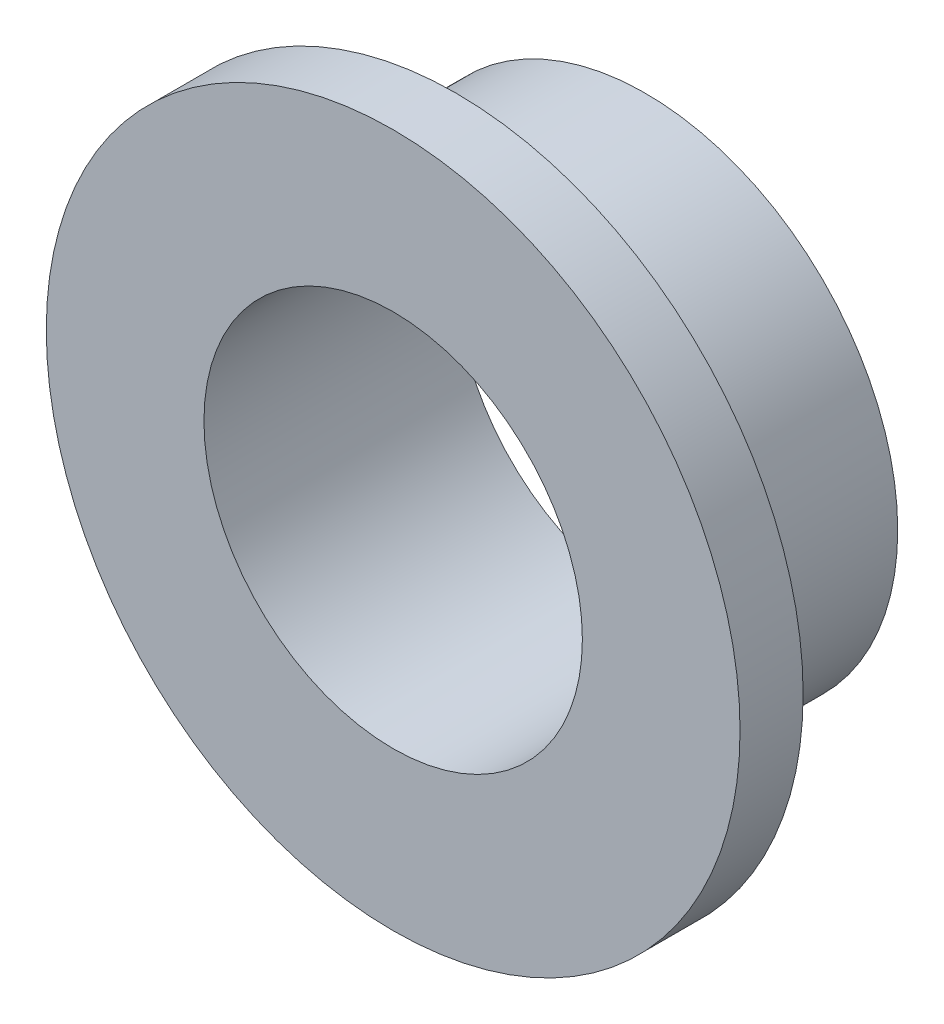
ISO-10303-21;
HEADER;
FILE_DESCRIPTION(('STEP AP214'),'2;1');
FILE_NAME('part.step','',(''),(''),'','','');
FILE_SCHEMA(('AUTOMOTIVE_DESIGN { 1 0 10303 214 1 1 1 1 }'));
ENDSEC;
DATA;
#1=APPLICATION_CONTEXT('core data for automotive mechanical design processes');
#2=APPLICATION_PROTOCOL_DEFINITION('international standard','automotive_design',2000,#1);
#3=PRODUCT_CONTEXT('',#1,'mechanical');
#4=PRODUCT('Part','Part','',(#3));
#5=PRODUCT_RELATED_PRODUCT_CATEGORY('part','',(#4));
#6=PRODUCT_DEFINITION_FORMATION('','',#4);
#7=PRODUCT_DEFINITION_CONTEXT('part definition',#1,'design');
#8=PRODUCT_DEFINITION('design','',#6,#7);
#9=PRODUCT_DEFINITION_SHAPE('','',#8);
#10=(LENGTH_UNIT() NAMED_UNIT(*) SI_UNIT(.MILLI.,.METRE.));
#11=(NAMED_UNIT(*) PLANE_ANGLE_UNIT() SI_UNIT($,.RADIAN.));
#12=(NAMED_UNIT(*) SI_UNIT($,.STERADIAN.) SOLID_ANGLE_UNIT());
#13=UNCERTAINTY_MEASURE_WITH_UNIT(LENGTH_MEASURE(1.E-05),#10,'distance_accuracy_value','');
#14=(GEOMETRIC_REPRESENTATION_CONTEXT(3) GLOBAL_UNCERTAINTY_ASSIGNED_CONTEXT((#13)) GLOBAL_UNIT_ASSIGNED_CONTEXT((#10,
#11,#12)) REPRESENTATION_CONTEXT('',''));
#15=CARTESIAN_POINT('',(0.,0.,0.));
#16=DIRECTION('',(0.,0.,1.));
#17=DIRECTION('',(1.,0.,0.));
#18=AXIS2_PLACEMENT_3D('',#15,#16,#17);
#19=CARTESIAN_POINT('',(0.,0.,6.35));
#20=DIRECTION('',(0.,0.,-1.));
#21=DIRECTION('',(-1.,0.,0.));
#22=AXIS2_PLACEMENT_3D('',#19,#20,#21);
#23=CYLINDRICAL_SURFACE('',#22,6.35);
#24=CARTESIAN_POINT('',(0.,0.,0.));
#25=DIRECTION('',(0.,0.,1.));
#26=DIRECTION('',(1.,0.,0.));
#27=AXIS2_PLACEMENT_3D('',#24,#25,#26);
#28=CIRCLE('',#27,6.35);
#29=CARTESIAN_POINT('',(6.35,0.,0.));
#30=VERTEX_POINT('',#29);
#31=EDGE_CURVE('E34',#30,#30,#28,.T.);
#32=ORIENTED_EDGE('',*,*,#31,.T.);
#33=EDGE_LOOP('',(#32));
#34=FACE_BOUND('',#33,.T.);
#35=CARTESIAN_POINT('',(0.,0.,4.7625));
#36=DIRECTION('',(0.,0.,1.));
#37=DIRECTION('',(1.,0.,0.));
#38=AXIS2_PLACEMENT_3D('',#35,#36,#37);
#39=CIRCLE('',#38,6.35);
#40=CARTESIAN_POINT('',(6.35,0.,4.7625));
#41=VERTEX_POINT('',#40);
#42=EDGE_CURVE('E10',#41,#41,#39,.T.);
#43=ORIENTED_EDGE('',*,*,#42,.F.);
#44=EDGE_LOOP('',(#43));
#45=FACE_BOUND('',#44,.T.);
#46=ADVANCED_FACE('F31',(#34,#45),#23,.T.);
#47=CARTESIAN_POINT('',(0.,0.,6.35));
#48=DIRECTION('',(0.,0.,1.));
#49=DIRECTION('',(1.,0.,0.));
#50=AXIS2_PLACEMENT_3D('',#47,#48,#49);
#51=PLANE('',#50);
#52=CARTESIAN_POINT('',(0.,0.,6.35));
#53=DIRECTION('',(0.,0.,1.));
#54=DIRECTION('',(1.,0.,0.));
#55=AXIS2_PLACEMENT_3D('',#52,#53,#54);
#56=CIRCLE('',#55,4.7625);
#57=CARTESIAN_POINT('',(4.7625,0.,6.35));
#58=VERTEX_POINT('',#57);
#59=EDGE_CURVE('E42',#58,#58,#56,.T.);
#60=ORIENTED_EDGE('',*,*,#59,.F.);
#61=EDGE_LOOP('',(#60));
#62=FACE_BOUND('',#61,.T.);
#63=CARTESIAN_POINT('',(0.,0.,6.35));
#64=DIRECTION('',(0.,0.,1.));
#65=DIRECTION('',(1.,0.,0.));
#66=AXIS2_PLACEMENT_3D('',#63,#64,#65);
#67=CIRCLE('',#66,8.73125);
#68=CARTESIAN_POINT('',(8.73125,0.,6.35));
#69=VERTEX_POINT('',#68);
#70=EDGE_CURVE('E45',#69,#69,#67,.T.);
#71=ORIENTED_EDGE('',*,*,#70,.T.);
#72=EDGE_LOOP('',(#71));
#73=FACE_BOUND('',#72,.T.);
#74=ADVANCED_FACE('F59',(#62,#73),#51,.T.);
#75=CARTESIAN_POINT('',(0.,0.,0.));
#76=DIRECTION('',(0.,0.,1.));
#77=DIRECTION('',(1.,0.,0.));
#78=AXIS2_PLACEMENT_3D('',#75,#76,#77);
#79=PLANE('',#78);
#80=ORIENTED_EDGE('',*,*,#31,.F.);
#81=EDGE_LOOP('',(#80));
#82=FACE_BOUND('',#81,.T.);
#83=CARTESIAN_POINT('',(0.,0.,0.));
#84=DIRECTION('',(0.,0.,1.));
#85=DIRECTION('',(1.,0.,0.));
#86=AXIS2_PLACEMENT_3D('',#83,#84,#85);
#87=CIRCLE('',#86,4.7625);
#88=CARTESIAN_POINT('',(4.7625,0.,0.));
#89=VERTEX_POINT('',#88);
#90=EDGE_CURVE('E48',#89,#89,#87,.T.);
#91=ORIENTED_EDGE('',*,*,#90,.T.);
#92=EDGE_LOOP('',(#91));
#93=FACE_BOUND('',#92,.T.);
#94=ADVANCED_FACE('F77',(#82,#93),#79,.F.);
#95=CARTESIAN_POINT('',(0.,0.,6.35));
#96=DIRECTION('',(0.,0.,-1.));
#97=DIRECTION('',(-1.,0.,0.));
#98=AXIS2_PLACEMENT_3D('',#95,#96,#97);
#99=CYLINDRICAL_SURFACE('',#98,4.7625);
#100=ORIENTED_EDGE('',*,*,#59,.T.);
#101=EDGE_LOOP('',(#100));
#102=FACE_BOUND('',#101,.T.);
#103=ORIENTED_EDGE('',*,*,#90,.F.);
#104=EDGE_LOOP('',(#103));
#105=FACE_BOUND('',#104,.T.);
#106=ADVANCED_FACE('F68',(#102,#105),#99,.F.);
#107=CARTESIAN_POINT('',(0.,0.,4.7625));
#108=DIRECTION('',(0.,0.,1.));
#109=DIRECTION('',(1.,0.,0.));
#110=AXIS2_PLACEMENT_3D('',#107,#108,#109);
#111=PLANE('',#110);
#112=CARTESIAN_POINT('',(0.,0.,4.7625));
#113=DIRECTION('',(0.,0.,1.));
#114=DIRECTION('',(1.,0.,0.));
#115=AXIS2_PLACEMENT_3D('',#112,#113,#114);
#116=CIRCLE('',#115,8.73125);
#117=CARTESIAN_POINT('',(8.73125,0.,4.7625));
#118=VERTEX_POINT('',#117);
#119=EDGE_CURVE('E50',#118,#118,#116,.T.);
#120=ORIENTED_EDGE('',*,*,#119,.F.);
#121=EDGE_LOOP('',(#120));
#122=FACE_BOUND('',#121,.T.);
#123=ORIENTED_EDGE('',*,*,#42,.T.);
#124=EDGE_LOOP('',(#123));
#125=FACE_BOUND('',#124,.T.);
#126=ADVANCED_FACE('F63',(#122,#125),#111,.F.);
#127=CARTESIAN_POINT('',(0.,0.,4.7625));
#128=DIRECTION('',(0.,0.,1.));
#129=DIRECTION('',(1.,0.,0.));
#130=AXIS2_PLACEMENT_3D('',#127,#128,#129);
#131=CYLINDRICAL_SURFACE('',#130,8.73125);
#132=ORIENTED_EDGE('',*,*,#119,.T.);
#133=EDGE_LOOP('',(#132));
#134=FACE_BOUND('',#133,.T.);
#135=ORIENTED_EDGE('',*,*,#70,.F.);
#136=EDGE_LOOP('',(#135));
#137=FACE_BOUND('',#136,.T.);
#138=ADVANCED_FACE('F61',(#134,#137),#131,.T.);
#139=CLOSED_SHELL('',(#46,#74,#94,#106,#126,#138));
#140=MANIFOLD_SOLID_BREP('B2',#139);
#141=ADVANCED_BREP_SHAPE_REPRESENTATION('',(#18,#140),#14);
#142=SHAPE_DEFINITION_REPRESENTATION(#9,#141);
ENDSEC;
END-ISO-10303-21;
